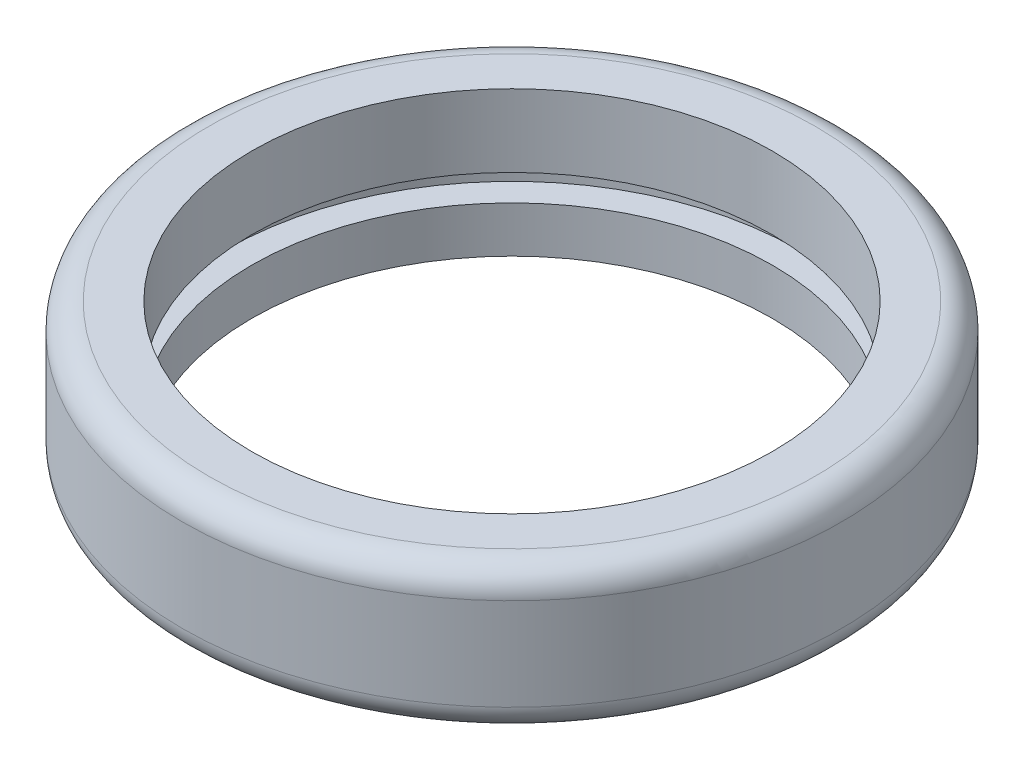
ISO-10303-21;
HEADER;
FILE_DESCRIPTION(('STEP AP214'),'2;1');
FILE_NAME('part.step','',(''),(''),'','','');
FILE_SCHEMA(('AUTOMOTIVE_DESIGN { 1 0 10303 214 1 1 1 1 }'));
ENDSEC;
DATA;
#1=APPLICATION_CONTEXT('core data for automotive mechanical design processes');
#2=APPLICATION_PROTOCOL_DEFINITION('international standard','automotive_design',2000,#1);
#3=PRODUCT_CONTEXT('',#1,'mechanical');
#4=PRODUCT('Part','Part','',(#3));
#5=PRODUCT_RELATED_PRODUCT_CATEGORY('part','',(#4));
#6=PRODUCT_DEFINITION_FORMATION('','',#4);
#7=PRODUCT_DEFINITION_CONTEXT('part definition',#1,'design');
#8=PRODUCT_DEFINITION('design','',#6,#7);
#9=PRODUCT_DEFINITION_SHAPE('','',#8);
#10=(LENGTH_UNIT() NAMED_UNIT(*) SI_UNIT(.MILLI.,.METRE.));
#11=(NAMED_UNIT(*) PLANE_ANGLE_UNIT() SI_UNIT($,.RADIAN.));
#12=(NAMED_UNIT(*) SI_UNIT($,.STERADIAN.) SOLID_ANGLE_UNIT());
#13=UNCERTAINTY_MEASURE_WITH_UNIT(LENGTH_MEASURE(1.E-05),#10,'distance_accuracy_value','');
#14=(GEOMETRIC_REPRESENTATION_CONTEXT(3) GLOBAL_UNCERTAINTY_ASSIGNED_CONTEXT((#13)) GLOBAL_UNIT_ASSIGNED_CONTEXT((#10,
#11,#12)) REPRESENTATION_CONTEXT('',''));
#15=CARTESIAN_POINT('',(0.,0.,0.));
#16=DIRECTION('',(0.,0.,1.));
#17=DIRECTION('',(1.,0.,0.));
#18=AXIS2_PLACEMENT_3D('',#15,#16,#17);
#19=CARTESIAN_POINT('',(25.,-5.5,0.));
#20=DIRECTION('',(0.,-1.,0.));
#21=DIRECTION('',(0.,0.,-1.));
#22=AXIS2_PLACEMENT_3D('',#19,#20,#21);
#23=PLANE('',#22);
#24=CARTESIAN_POINT('',(0.,-5.5,0.));
#25=DIRECTION('',(0.,-1.,0.));
#26=DIRECTION('',(0.,0.,-1.));
#27=AXIS2_PLACEMENT_3D('',#24,#25,#26);
#28=CIRCLE('',#27,23.);
#29=CARTESIAN_POINT('',(0.,-5.5,-23.));
#30=VERTEX_POINT('',#29);
#31=EDGE_CURVE('E61',#30,#30,#28,.T.);
#32=ORIENTED_EDGE('',*,*,#31,.T.);
#33=EDGE_LOOP('',(#32));
#34=FACE_BOUND('',#33,.T.);
#35=CARTESIAN_POINT('',(0.,-5.5,0.));
#36=DIRECTION('',(0.,-1.,0.));
#37=DIRECTION('',(0.,0.,-1.));
#38=AXIS2_PLACEMENT_3D('',#35,#36,#37);
#39=CIRCLE('',#38,19.75);
#40=CARTESIAN_POINT('',(0.,-5.5,-19.75));
#41=VERTEX_POINT('',#40);
#42=EDGE_CURVE('E67',#41,#41,#39,.T.);
#43=ORIENTED_EDGE('',*,*,#42,.F.);
#44=EDGE_LOOP('',(#43));
#45=FACE_BOUND('',#44,.T.);
#46=ADVANCED_FACE('F43',(#34,#45),#23,.T.);
#47=CARTESIAN_POINT('',(0.,0.,0.));
#48=DIRECTION('',(0.,-1.,0.));
#49=DIRECTION('',(0.,0.,-1.));
#50=AXIS2_PLACEMENT_3D('',#47,#48,#49);
#51=CYLINDRICAL_SURFACE('',#50,19.75);
#52=ORIENTED_EDGE('',*,*,#42,.T.);
#53=EDGE_LOOP('',(#52));
#54=FACE_BOUND('',#53,.T.);
#55=CARTESIAN_POINT('',(0.,-2.,0.));
#56=DIRECTION('',(0.,-1.,0.));
#57=DIRECTION('',(0.,0.,-1.));
#58=AXIS2_PLACEMENT_3D('',#55,#56,#57);
#59=CIRCLE('',#58,19.75);
#60=CARTESIAN_POINT('',(0.,-2.,-19.75));
#61=VERTEX_POINT('',#60);
#62=EDGE_CURVE('E71',#61,#61,#59,.T.);
#63=ORIENTED_EDGE('',*,*,#62,.F.);
#64=EDGE_LOOP('',(#63));
#65=FACE_BOUND('',#64,.T.);
#66=ADVANCED_FACE('F109',(#54,#65),#51,.F.);
#67=CARTESIAN_POINT('',(19.75,-2.,0.));
#68=DIRECTION('',(0.,1.,0.));
#69=DIRECTION('',(0.,0.,1.));
#70=AXIS2_PLACEMENT_3D('',#67,#68,#69);
#71=PLANE('',#70);
#72=ORIENTED_EDGE('',*,*,#62,.T.);
#73=EDGE_LOOP('',(#72));
#74=FACE_BOUND('',#73,.T.);
#75=CARTESIAN_POINT('',(0.,-2.,0.));
#76=DIRECTION('',(0.,-1.,0.));
#77=DIRECTION('',(0.,0.,-1.));
#78=AXIS2_PLACEMENT_3D('',#75,#76,#77);
#79=CIRCLE('',#78,21.75);
#80=CARTESIAN_POINT('',(0.,-2.,-21.75));
#81=VERTEX_POINT('',#80);
#82=EDGE_CURVE('E75',#81,#81,#79,.T.);
#83=ORIENTED_EDGE('',*,*,#82,.F.);
#84=EDGE_LOOP('',(#83));
#85=FACE_BOUND('',#84,.T.);
#86=ADVANCED_FACE('F115',(#74,#85),#71,.T.);
#87=CARTESIAN_POINT('',(0.,0.,0.));
#88=DIRECTION('',(0.,-1.,0.));
#89=DIRECTION('',(0.,0.,-1.));
#90=AXIS2_PLACEMENT_3D('',#87,#88,#89);
#91=CYLINDRICAL_SURFACE('',#90,21.75);
#92=ORIENTED_EDGE('',*,*,#82,.T.);
#93=EDGE_LOOP('',(#92));
#94=FACE_BOUND('',#93,.T.);
#95=CARTESIAN_POINT('',(0.,0.,0.));
#96=DIRECTION('',(0.,-1.,0.));
#97=DIRECTION('',(0.,0.,-1.));
#98=AXIS2_PLACEMENT_3D('',#95,#96,#97);
#99=CIRCLE('',#98,21.75);
#100=CARTESIAN_POINT('',(0.,0.,-21.75));
#101=VERTEX_POINT('',#100);
#102=EDGE_CURVE('E79',#101,#101,#99,.T.);
#103=ORIENTED_EDGE('',*,*,#102,.F.);
#104=EDGE_LOOP('',(#103));
#105=FACE_BOUND('',#104,.T.);
#106=ADVANCED_FACE('F106',(#94,#105),#91,.F.);
#107=CARTESIAN_POINT('',(21.75,0.,0.));
#108=DIRECTION('',(0.,-1.,0.));
#109=DIRECTION('',(0.,0.,-1.));
#110=AXIS2_PLACEMENT_3D('',#107,#108,#109);
#111=PLANE('',#110);
#112=ORIENTED_EDGE('',*,*,#102,.T.);
#113=EDGE_LOOP('',(#112));
#114=FACE_BOUND('',#113,.T.);
#115=CARTESIAN_POINT('',(0.,0.,0.));
#116=DIRECTION('',(0.,-1.,0.));
#117=DIRECTION('',(0.,0.,-1.));
#118=AXIS2_PLACEMENT_3D('',#115,#116,#117);
#119=CIRCLE('',#118,19.75);
#120=CARTESIAN_POINT('',(0.,0.,-19.75));
#121=VERTEX_POINT('',#120);
#122=EDGE_CURVE('E83',#121,#121,#119,.T.);
#123=ORIENTED_EDGE('',*,*,#122,.F.);
#124=EDGE_LOOP('',(#123));
#125=FACE_BOUND('',#124,.T.);
#126=ADVANCED_FACE('F96',(#114,#125),#111,.T.);
#127=CARTESIAN_POINT('',(0.,0.,0.));
#128=DIRECTION('',(0.,-1.,0.));
#129=DIRECTION('',(0.,0.,-1.));
#130=AXIS2_PLACEMENT_3D('',#127,#128,#129);
#131=CYLINDRICAL_SURFACE('',#130,19.75);
#132=ORIENTED_EDGE('',*,*,#122,.T.);
#133=EDGE_LOOP('',(#132));
#134=FACE_BOUND('',#133,.T.);
#135=CARTESIAN_POINT('',(0.,5.5,0.));
#136=DIRECTION('',(0.,-1.,0.));
#137=DIRECTION('',(0.,0.,-1.));
#138=AXIS2_PLACEMENT_3D('',#135,#136,#137);
#139=CIRCLE('',#138,19.75);
#140=CARTESIAN_POINT('',(0.,5.5,-19.75));
#141=VERTEX_POINT('',#140);
#142=EDGE_CURVE('E87',#141,#141,#139,.T.);
#143=ORIENTED_EDGE('',*,*,#142,.F.);
#144=EDGE_LOOP('',(#143));
#145=FACE_BOUND('',#144,.T.);
#146=ADVANCED_FACE('F94',(#134,#145),#131,.F.);
#147=CARTESIAN_POINT('',(19.75,5.5,0.));
#148=DIRECTION('',(0.,1.,0.));
#149=DIRECTION('',(0.,0.,1.));
#150=AXIS2_PLACEMENT_3D('',#147,#148,#149);
#151=PLANE('',#150);
#152=CARTESIAN_POINT('',(0.,5.5,0.));
#153=DIRECTION('',(0.,1.,0.));
#154=DIRECTION('',(0.,0.,1.));
#155=AXIS2_PLACEMENT_3D('',#152,#153,#154);
#156=CIRCLE('',#155,23.);
#157=CARTESIAN_POINT('',(0.,5.5,23.));
#158=VERTEX_POINT('',#157);
#159=EDGE_CURVE('E10',#158,#158,#156,.T.);
#160=ORIENTED_EDGE('',*,*,#159,.T.);
#161=EDGE_LOOP('',(#160));
#162=FACE_BOUND('',#161,.T.);
#163=ORIENTED_EDGE('',*,*,#142,.T.);
#164=EDGE_LOOP('',(#163));
#165=FACE_BOUND('',#164,.T.);
#166=ADVANCED_FACE('F92',(#162,#165),#151,.T.);
#167=CARTESIAN_POINT('',(0.,0.,0.));
#168=DIRECTION('',(0.,-1.,0.));
#169=DIRECTION('',(0.,0.,-1.));
#170=AXIS2_PLACEMENT_3D('',#167,#168,#169);
#171=CYLINDRICAL_SURFACE('',#170,25.);
#172=CARTESIAN_POINT('',(0.,-3.5,0.));
#173=DIRECTION('',(0.,-1.,0.));
#174=DIRECTION('',(0.,0.,-1.));
#175=AXIS2_PLACEMENT_3D('',#172,#173,#174);
#176=CIRCLE('',#175,25.);
#177=CARTESIAN_POINT('',(0.,-3.5,-25.));
#178=VERTEX_POINT('',#177);
#179=EDGE_CURVE('E51',#178,#178,#176,.F.);
#180=ORIENTED_EDGE('',*,*,#179,.T.);
#181=EDGE_LOOP('',(#180));
#182=FACE_BOUND('',#181,.T.);
#183=CARTESIAN_POINT('',(0.,3.5,0.));
#184=DIRECTION('',(0.,1.,0.));
#185=DIRECTION('',(0.,0.,1.));
#186=AXIS2_PLACEMENT_3D('',#183,#184,#185);
#187=CIRCLE('',#186,25.);
#188=CARTESIAN_POINT('',(0.,3.5,25.));
#189=VERTEX_POINT('',#188);
#190=EDGE_CURVE('E56',#189,#189,#187,.F.);
#191=ORIENTED_EDGE('',*,*,#190,.T.);
#192=EDGE_LOOP('',(#191));
#193=FACE_BOUND('',#192,.T.);
#194=ADVANCED_FACE('F104',(#182,#193),#171,.T.);
#195=CARTESIAN_POINT('',(0.,-3.5,0.));
#196=DIRECTION('',(0.,-1.,0.));
#197=DIRECTION('',(0.,0.,-1.));
#198=AXIS2_PLACEMENT_3D('',#195,#196,#197);
#199=TOROIDAL_SURFACE('',#198,23.,2.);
#200=ORIENTED_EDGE('',*,*,#179,.F.);
#201=EDGE_LOOP('',(#200));
#202=FACE_BOUND('',#201,.T.);
#203=ORIENTED_EDGE('',*,*,#31,.F.);
#204=EDGE_LOOP('',(#203));
#205=FACE_BOUND('',#204,.T.);
#206=ADVANCED_FACE('F120',(#202,#205),#199,.T.);
#207=CARTESIAN_POINT('',(0.,3.5,0.));
#208=DIRECTION('',(0.,1.,0.));
#209=DIRECTION('',(0.,0.,1.));
#210=AXIS2_PLACEMENT_3D('',#207,#208,#209);
#211=TOROIDAL_SURFACE('',#210,23.,2.);
#212=ORIENTED_EDGE('',*,*,#159,.F.);
#213=EDGE_LOOP('',(#212));
#214=FACE_BOUND('',#213,.T.);
#215=ORIENTED_EDGE('',*,*,#190,.F.);
#216=EDGE_LOOP('',(#215));
#217=FACE_BOUND('',#216,.T.);
#218=ADVANCED_FACE('F45',(#214,#217),#211,.T.);
#219=CLOSED_SHELL('',(#46,#66,#86,#106,#126,#146,#166,#194,#206,#218));
#220=MANIFOLD_SOLID_BREP('B2',#219);
#221=ADVANCED_BREP_SHAPE_REPRESENTATION('',(#18,#220),#14);
#222=SHAPE_DEFINITION_REPRESENTATION(#9,#221);
ENDSEC;
END-ISO-10303-21;
